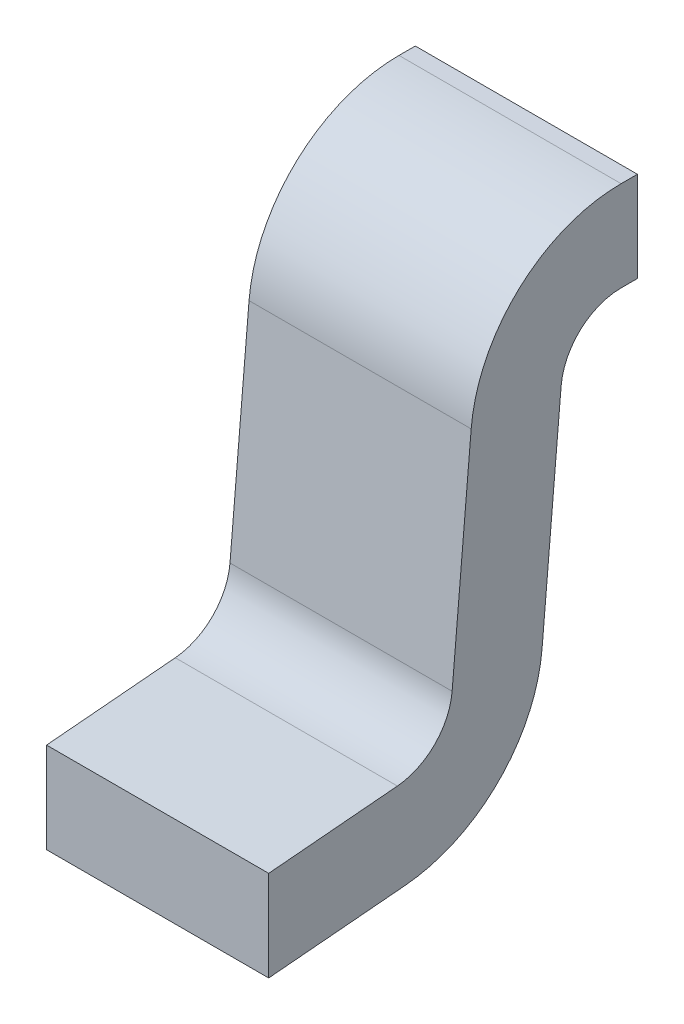
ISO-10303-21;
HEADER;
FILE_DESCRIPTION(('STEP AP214'),'2;1');
FILE_NAME('part.step','',(''),(''),'','','');
FILE_SCHEMA(('AUTOMOTIVE_DESIGN { 1 0 10303 214 1 1 1 1 }'));
ENDSEC;
DATA;
#1=APPLICATION_CONTEXT('core data for automotive mechanical design processes');
#2=APPLICATION_PROTOCOL_DEFINITION('international standard','automotive_design',2000,#1);
#3=PRODUCT_CONTEXT('',#1,'mechanical');
#4=PRODUCT('Part','Part','',(#3));
#5=PRODUCT_RELATED_PRODUCT_CATEGORY('part','',(#4));
#6=PRODUCT_DEFINITION_FORMATION('','',#4);
#7=PRODUCT_DEFINITION_CONTEXT('part definition',#1,'design');
#8=PRODUCT_DEFINITION('design','',#6,#7);
#9=PRODUCT_DEFINITION_SHAPE('','',#8);
#10=(LENGTH_UNIT() NAMED_UNIT(*) SI_UNIT(.MILLI.,.METRE.));
#11=(NAMED_UNIT(*) PLANE_ANGLE_UNIT() SI_UNIT($,.RADIAN.));
#12=(NAMED_UNIT(*) SI_UNIT($,.STERADIAN.) SOLID_ANGLE_UNIT());
#13=UNCERTAINTY_MEASURE_WITH_UNIT(LENGTH_MEASURE(1.E-05),#10,'distance_accuracy_value','');
#14=(GEOMETRIC_REPRESENTATION_CONTEXT(3) GLOBAL_UNCERTAINTY_ASSIGNED_CONTEXT((#13)) GLOBAL_UNIT_ASSIGNED_CONTEXT((#10,
#11,#12)) REPRESENTATION_CONTEXT('',''));
#15=CARTESIAN_POINT('',(0.,0.,0.));
#16=DIRECTION('',(0.,0.,1.));
#17=DIRECTION('',(1.,0.,0.));
#18=AXIS2_PLACEMENT_3D('',#15,#16,#17);
#19=CARTESIAN_POINT('',(-0.187452,0.,0.));
#20=DIRECTION('',(1.,0.,0.));
#21=DIRECTION('',(0.,1.,0.));
#22=AXIS2_PLACEMENT_3D('',#19,#20,#21);
#23=PLANE('',#22);
#24=DIRECTION('',(0.,-0.0871557427476379,0.996194698091747));
#25=VECTOR('',#24,1.);
#26=CARTESIAN_POINT('',(-0.187452,-0.03121454129347,0.23999111031));
#27=LINE('',#26,#25);
#28=CARTESIAN_POINT('',(-0.187452,-0.03121454129347,0.23999111031));
#29=VERTEX_POINT('',#28);
#30=CARTESIAN_POINT('',(-0.187452,-0.0502178567584,0.4572));
#31=VERTEX_POINT('',#30);
#32=EDGE_CURVE('E39',#29,#31,#27,.T.);
#33=ORIENTED_EDGE('',*,*,#32,.F.);
#34=CARTESIAN_POINT('',(-0.187452,0.06999884003265,0.248846133773));
#35=DIRECTION('',(1.,0.,0.));
#36=DIRECTION('',(0.,-0.996194698091747,-0.0871557427476379));
#37=AXIS2_PLACEMENT_3D('',#34,#35,#36);
#38=CIRCLE('',#37,0.1016);
#39=CARTESIAN_POINT('',(-0.187452,0.0611438165695,0.147632752447));
#40=VERTEX_POINT('',#39);
#41=EDGE_CURVE('E11',#29,#40,#38,.T.);
#42=ORIENTED_EDGE('',*,*,#41,.T.);
#43=DIRECTION('',(0.,0.996194698091747,-0.0871557427476379));
#44=VECTOR('',#43,1.);
#45=CARTESIAN_POINT('',(-0.187452,0.0611438165695,0.147632752447));
#46=LINE('',#45,#44);
#47=CARTESIAN_POINT('',(-0.187452,0.428537558658,0.115489964964));
#48=VERTEX_POINT('',#47);
#49=EDGE_CURVE('E26',#40,#48,#46,.T.);
#50=ORIENTED_EDGE('',*,*,#49,.T.);
#51=CARTESIAN_POINT('',(-0.187452,0.4064,-0.137543488351));
#52=DIRECTION('',(-1.,0.,0.));
#53=DIRECTION('',(0.,0.0871557427476379,0.996194698091747));
#54=AXIS2_PLACEMENT_3D('',#51,#52,#53);
#55=CIRCLE('',#54,0.254);
#56=CARTESIAN_POINT('',(-0.187452,0.6604,-0.137543488351));
#57=VERTEX_POINT('',#56);
#58=EDGE_CURVE('E220',#48,#57,#55,.T.);
#59=ORIENTED_EDGE('',*,*,#58,.T.);
#60=DIRECTION('',(0.,0.,1.));
#61=VECTOR('',#60,1.);
#62=CARTESIAN_POINT('',(-0.187452,0.6604,-0.1651));
#63=LINE('',#62,#61);
#64=CARTESIAN_POINT('',(-0.187452,0.6604,-0.1651));
#65=VERTEX_POINT('',#64);
#66=EDGE_CURVE('E251',#65,#57,#63,.T.);
#67=ORIENTED_EDGE('',*,*,#66,.F.);
#68=DIRECTION('',(0.,1.,0.));
#69=VECTOR('',#68,1.);
#70=CARTESIAN_POINT('',(-0.187452,0.508,-0.1651));
#71=LINE('',#70,#69);
#72=CARTESIAN_POINT('',(-0.187452,0.508,-0.1651));
#73=VERTEX_POINT('',#72);
#74=EDGE_CURVE('E194',#73,#65,#71,.T.);
#75=ORIENTED_EDGE('',*,*,#74,.F.);
#76=DIRECTION('',(0.,0.,-1.));
#77=VECTOR('',#76,1.);
#78=CARTESIAN_POINT('',(-0.187452,0.508,-0.137543488351));
#79=LINE('',#78,#77);
#80=CARTESIAN_POINT('',(-0.187452,0.508,-0.137543488351));
#81=VERTEX_POINT('',#80);
#82=EDGE_CURVE('E195',#81,#73,#79,.T.);
#83=ORIENTED_EDGE('',*,*,#82,.F.);
#84=CARTESIAN_POINT('',(-0.187452,0.4064,-0.137543488351));
#85=DIRECTION('',(1.,0.,0.));
#86=DIRECTION('',(0.,1.,0.));
#87=AXIS2_PLACEMENT_3D('',#84,#85,#86);
#88=CIRCLE('',#87,0.1016);
#89=CARTESIAN_POINT('',(-0.187452,0.415255023463,-0.03633010702521));
#90=VERTEX_POINT('',#89);
#91=EDGE_CURVE('E224',#81,#90,#88,.T.);
#92=ORIENTED_EDGE('',*,*,#91,.T.);
#93=DIRECTION('',(0.,-0.996194698091747,0.0871557427476379));
#94=VECTOR('',#93,1.);
#95=CARTESIAN_POINT('',(-0.187452,0.415255023463,-0.03633010702521));
#96=LINE('',#95,#94);
#97=CARTESIAN_POINT('',(-0.187452,0.04786128137476,-0.004187319542116));
#98=VERTEX_POINT('',#97);
#99=EDGE_CURVE('E228',#90,#98,#96,.T.);
#100=ORIENTED_EDGE('',*,*,#99,.T.);
#101=CARTESIAN_POINT('',(-0.187452,0.06999884003265,0.248846133773));
#102=DIRECTION('',(-1.,0.,0.));
#103=DIRECTION('',(0.,-0.0871557427476379,-0.996194698091747));
#104=AXIS2_PLACEMENT_3D('',#101,#102,#103);
#105=CIRCLE('',#104,0.254);
#106=CARTESIAN_POINT('',(-0.187452,-0.183034613283,0.226708575115));
#107=VERTEX_POINT('',#106);
#108=EDGE_CURVE('E269',#98,#107,#105,.T.);
#109=ORIENTED_EDGE('',*,*,#108,.T.);
#110=DIRECTION('',(0.,0.0871557427476379,-0.996194698091747));
#111=VECTOR('',#110,1.);
#112=CARTESIAN_POINT('',(-0.187452,-0.2032,0.4572));
#113=LINE('',#112,#111);
#114=CARTESIAN_POINT('',(-0.187452,-0.2032,0.4572));
#115=VERTEX_POINT('',#114);
#116=EDGE_CURVE('E208',#115,#107,#113,.T.);
#117=ORIENTED_EDGE('',*,*,#116,.F.);
#118=DIRECTION('',(0.,1.,0.));
#119=VECTOR('',#118,1.);
#120=CARTESIAN_POINT('',(-0.187452,-0.2032,0.4572));
#121=LINE('',#120,#119);
#122=EDGE_CURVE('E164',#115,#31,#121,.T.);
#123=ORIENTED_EDGE('',*,*,#122,.T.);
#124=EDGE_LOOP('',(#33,#42,#50,#59,#67,#75,#83,#92,#100,#109,#117,#123));
#125=FACE_BOUND('',#124,.T.);
#126=ADVANCED_FACE('F16',(#125),#23,.F.);
#127=CARTESIAN_POINT('',(0.2249424,-0.2032,0.4572));
#128=DIRECTION('',(0.,0.,-1.));
#129=DIRECTION('',(0.,-1.,0.));
#130=AXIS2_PLACEMENT_3D('',#127,#128,#129);
#131=PLANE('',#130);
#132=DIRECTION('',(1.,0.,0.));
#133=VECTOR('',#132,1.);
#134=CARTESIAN_POINT('',(-0.187452,-0.2032,0.4572));
#135=LINE('',#134,#133);
#136=CARTESIAN_POINT('',(0.187452,-0.2032,0.4572));
#137=VERTEX_POINT('',#136);
#138=EDGE_CURVE('E159',#115,#137,#135,.T.);
#139=ORIENTED_EDGE('',*,*,#138,.T.);
#140=DIRECTION('',(0.,1.,0.));
#141=VECTOR('',#140,1.);
#142=CARTESIAN_POINT('',(0.187452,-0.2032,0.4572));
#143=LINE('',#142,#141);
#144=CARTESIAN_POINT('',(0.187452,-0.0502178567584,0.4572));
#145=VERTEX_POINT('',#144);
#146=EDGE_CURVE('E147',#137,#145,#143,.T.);
#147=ORIENTED_EDGE('',*,*,#146,.T.);
#148=DIRECTION('',(1.,0.,0.));
#149=VECTOR('',#148,1.);
#150=CARTESIAN_POINT('',(-0.187452,-0.0502178567584,0.4572));
#151=LINE('',#150,#149);
#152=EDGE_CURVE('E186',#31,#145,#151,.T.);
#153=ORIENTED_EDGE('',*,*,#152,.F.);
#154=ORIENTED_EDGE('',*,*,#122,.F.);
#155=EDGE_LOOP('',(#139,#147,#153,#154));
#156=FACE_BOUND('',#155,.T.);
#157=ADVANCED_FACE('F163',(#156),#131,.F.);
#158=CARTESIAN_POINT('',(-0.187452,-0.02378429437146,0.155062999369));
#159=DIRECTION('',(0.,0.996194698091747,0.0871557427476379));
#160=DIRECTION('',(1.,0.,0.));
#161=AXIS2_PLACEMENT_3D('',#158,#159,#160);
#162=PLANE('',#161);
#163=DIRECTION('',(0.,-0.0871557427476379,0.996194698091747));
#164=VECTOR('',#163,1.);
#165=CARTESIAN_POINT('',(0.187452,-0.03121454129347,0.23999111031));
#166=LINE('',#165,#164);
#167=CARTESIAN_POINT('',(0.187452,-0.03121454129347,0.23999111031));
#168=VERTEX_POINT('',#167);
#169=EDGE_CURVE('E155',#168,#145,#166,.T.);
#170=ORIENTED_EDGE('',*,*,#169,.F.);
#171=DIRECTION('',(1.,0.,0.));
#172=VECTOR('',#171,1.);
#173=CARTESIAN_POINT('',(-0.187452,-0.03121454129347,0.23999111031));
#174=LINE('',#173,#172);
#175=EDGE_CURVE('E273',#29,#168,#174,.T.);
#176=ORIENTED_EDGE('',*,*,#175,.F.);
#177=ORIENTED_EDGE('',*,*,#32,.T.);
#178=ORIENTED_EDGE('',*,*,#152,.T.);
#179=EDGE_LOOP('',(#170,#176,#177,#178));
#180=FACE_BOUND('',#179,.T.);
#181=ADVANCED_FACE('F342',(#180),#162,.T.);
#182=CARTESIAN_POINT('',(-0.187452,0.06999884003265,0.248846133773));
#183=DIRECTION('',(1.,0.,0.));
#184=DIRECTION('',(0.,-0.996194698091747,-0.0871557427476379));
#185=AXIS2_PLACEMENT_3D('',#182,#183,#184);
#186=CYLINDRICAL_SURFACE('',#185,0.1016);
#187=CARTESIAN_POINT('',(0.187452,0.06999884003265,0.248846133773));
#188=DIRECTION('',(1.,0.,0.));
#189=DIRECTION('',(0.,-0.996194698091747,-0.0871557427476379));
#190=AXIS2_PLACEMENT_3D('',#187,#188,#189);
#191=CIRCLE('',#190,0.1016);
#192=CARTESIAN_POINT('',(0.187452,0.0611438165695,0.147632752447));
#193=VERTEX_POINT('',#192);
#194=EDGE_CURVE('E189',#168,#193,#191,.T.);
#195=ORIENTED_EDGE('',*,*,#194,.T.);
#196=DIRECTION('',(1.,0.,0.));
#197=VECTOR('',#196,1.);
#198=CARTESIAN_POINT('',(-0.187452,0.0611438165695,0.147632752447));
#199=LINE('',#198,#197);
#200=EDGE_CURVE('E199',#40,#193,#199,.T.);
#201=ORIENTED_EDGE('',*,*,#200,.F.);
#202=ORIENTED_EDGE('',*,*,#41,.F.);
#203=ORIENTED_EDGE('',*,*,#175,.T.);
#204=EDGE_LOOP('',(#195,#201,#202,#203));
#205=FACE_BOUND('',#204,.T.);
#206=ADVANCED_FACE('F348',(#205),#186,.F.);
#207=CARTESIAN_POINT('',(-0.187452,0.01328253519474,0.151820071989));
#208=DIRECTION('',(0.,0.0871557427476379,0.996194698091747));
#209=DIRECTION('',(1.,0.,0.));
#210=AXIS2_PLACEMENT_3D('',#207,#208,#209);
#211=PLANE('',#210);
#212=ORIENTED_EDGE('',*,*,#200,.T.);
#213=DIRECTION('',(0.,-0.996194698091747,0.0871557427476379));
#214=VECTOR('',#213,1.);
#215=CARTESIAN_POINT('',(0.187452,0.428537558658,0.115489964964));
#216=LINE('',#215,#214);
#217=CARTESIAN_POINT('',(0.187452,0.428537558658,0.115489964964));
#218=VERTEX_POINT('',#217);
#219=EDGE_CURVE('E68',#218,#193,#216,.T.);
#220=ORIENTED_EDGE('',*,*,#219,.F.);
#221=DIRECTION('',(1.,0.,0.));
#222=VECTOR('',#221,1.);
#223=CARTESIAN_POINT('',(-0.187452,0.428537558658,0.115489964964));
#224=LINE('',#223,#222);
#225=EDGE_CURVE('E200',#48,#218,#224,.T.);
#226=ORIENTED_EDGE('',*,*,#225,.F.);
#227=ORIENTED_EDGE('',*,*,#49,.F.);
#228=EDGE_LOOP('',(#212,#220,#226,#227));
#229=FACE_BOUND('',#228,.T.);
#230=ADVANCED_FACE('F237',(#229),#211,.T.);
#231=CARTESIAN_POINT('',(-0.187452,0.4064,-0.137543488351));
#232=DIRECTION('',(-1.,0.,0.));
#233=DIRECTION('',(0.,0.0871557427476379,0.996194698091747));
#234=AXIS2_PLACEMENT_3D('',#231,#232,#233);
#235=CYLINDRICAL_SURFACE('',#234,0.254);
#236=CARTESIAN_POINT('',(0.187452,0.4064,-0.137543488351));
#237=DIRECTION('',(-1.,0.,0.));
#238=DIRECTION('',(0.,0.0871557427476379,0.996194698091747));
#239=AXIS2_PLACEMENT_3D('',#236,#237,#238);
#240=CIRCLE('',#239,0.254);
#241=CARTESIAN_POINT('',(0.187452,0.6604,-0.137543488351));
#242=VERTEX_POINT('',#241);
#243=EDGE_CURVE('E196',#218,#242,#240,.T.);
#244=ORIENTED_EDGE('',*,*,#243,.T.);
#245=DIRECTION('',(1.,0.,0.));
#246=VECTOR('',#245,1.);
#247=CARTESIAN_POINT('',(-0.187452,0.6604,-0.137543488351));
#248=LINE('',#247,#246);
#249=EDGE_CURVE('E80',#57,#242,#248,.T.);
#250=ORIENTED_EDGE('',*,*,#249,.F.);
#251=ORIENTED_EDGE('',*,*,#58,.F.);
#252=ORIENTED_EDGE('',*,*,#225,.T.);
#253=EDGE_LOOP('',(#244,#250,#251,#252));
#254=FACE_BOUND('',#253,.T.);
#255=ADVANCED_FACE('F240',(#254),#235,.T.);
#256=CARTESIAN_POINT('',(-0.187452,0.6604,-0.1651));
#257=DIRECTION('',(0.,1.,0.));
#258=DIRECTION('',(1.,0.,0.));
#259=AXIS2_PLACEMENT_3D('',#256,#257,#258);
#260=PLANE('',#259);
#261=ORIENTED_EDGE('',*,*,#249,.T.);
#262=DIRECTION('',(0.,0.,1.));
#263=VECTOR('',#262,1.);
#264=CARTESIAN_POINT('',(0.187452,0.6604,-0.1651));
#265=LINE('',#264,#263);
#266=CARTESIAN_POINT('',(0.187452,0.6604,-0.1651));
#267=VERTEX_POINT('',#266);
#268=EDGE_CURVE('E201',#267,#242,#265,.T.);
#269=ORIENTED_EDGE('',*,*,#268,.F.);
#270=DIRECTION('',(1.,0.,0.));
#271=VECTOR('',#270,1.);
#272=CARTESIAN_POINT('',(-0.187452,0.6604,-0.1651));
#273=LINE('',#272,#271);
#274=EDGE_CURVE('E245',#65,#267,#273,.T.);
#275=ORIENTED_EDGE('',*,*,#274,.F.);
#276=ORIENTED_EDGE('',*,*,#66,.T.);
#277=EDGE_LOOP('',(#261,#269,#275,#276));
#278=FACE_BOUND('',#277,.T.);
#279=ADVANCED_FACE('F244',(#278),#260,.T.);
#280=CARTESIAN_POINT('',(-0.187452,0.508,-0.1651));
#281=DIRECTION('',(0.,0.,-1.));
#282=DIRECTION('',(0.,-1.,0.));
#283=AXIS2_PLACEMENT_3D('',#280,#281,#282);
#284=PLANE('',#283);
#285=ORIENTED_EDGE('',*,*,#274,.T.);
#286=DIRECTION('',(0.,1.,0.));
#287=VECTOR('',#286,1.);
#288=CARTESIAN_POINT('',(0.187452,0.508,-0.1651));
#289=LINE('',#288,#287);
#290=CARTESIAN_POINT('',(0.187452,0.508,-0.1651));
#291=VERTEX_POINT('',#290);
#292=EDGE_CURVE('E205',#291,#267,#289,.T.);
#293=ORIENTED_EDGE('',*,*,#292,.F.);
#294=DIRECTION('',(1.,0.,0.));
#295=VECTOR('',#294,1.);
#296=CARTESIAN_POINT('',(-0.187452,0.508,-0.1651));
#297=LINE('',#296,#295);
#298=EDGE_CURVE('E190',#73,#291,#297,.T.);
#299=ORIENTED_EDGE('',*,*,#298,.F.);
#300=ORIENTED_EDGE('',*,*,#74,.T.);
#301=EDGE_LOOP('',(#285,#293,#299,#300));
#302=FACE_BOUND('',#301,.T.);
#303=ADVANCED_FACE('F247',(#302),#284,.T.);
#304=CARTESIAN_POINT('',(-0.187452,0.508,-0.04444424107116));
#305=DIRECTION('',(0.,-1.,0.));
#306=DIRECTION('',(0.,0.,-1.));
#307=AXIS2_PLACEMENT_3D('',#304,#305,#306);
#308=PLANE('',#307);
#309=ORIENTED_EDGE('',*,*,#298,.T.);
#310=DIRECTION('',(0.,0.,-1.));
#311=VECTOR('',#310,1.);
#312=CARTESIAN_POINT('',(0.187452,0.508,-0.137543488351));
#313=LINE('',#312,#311);
#314=CARTESIAN_POINT('',(0.187452,0.508,-0.137543488351));
#315=VERTEX_POINT('',#314);
#316=EDGE_CURVE('E181',#315,#291,#313,.T.);
#317=ORIENTED_EDGE('',*,*,#316,.F.);
#318=DIRECTION('',(1.,0.,0.));
#319=VECTOR('',#318,1.);
#320=CARTESIAN_POINT('',(-0.187452,0.508,-0.137543488351));
#321=LINE('',#320,#319);
#322=EDGE_CURVE('E179',#81,#315,#321,.T.);
#323=ORIENTED_EDGE('',*,*,#322,.F.);
#324=ORIENTED_EDGE('',*,*,#82,.T.);
#325=EDGE_LOOP('',(#309,#317,#323,#324));
#326=FACE_BOUND('',#325,.T.);
#327=ADVANCED_FACE('F404',(#326),#308,.T.);
#328=CARTESIAN_POINT('',(-0.187452,0.4064,-0.137543488351));
#329=DIRECTION('',(1.,0.,0.));
#330=DIRECTION('',(0.,1.,0.));
#331=AXIS2_PLACEMENT_3D('',#328,#329,#330);
#332=CYLINDRICAL_SURFACE('',#331,0.1016);
#333=CARTESIAN_POINT('',(0.187452,0.4064,-0.137543488351));
#334=DIRECTION('',(1.,0.,0.));
#335=DIRECTION('',(0.,1.,0.));
#336=AXIS2_PLACEMENT_3D('',#333,#334,#335);
#337=CIRCLE('',#336,0.1016);
#338=CARTESIAN_POINT('',(0.187452,0.415255023463,-0.03633010702521));
#339=VERTEX_POINT('',#338);
#340=EDGE_CURVE('E219',#315,#339,#337,.T.);
#341=ORIENTED_EDGE('',*,*,#340,.T.);
#342=DIRECTION('',(1.,0.,0.));
#343=VECTOR('',#342,1.);
#344=CARTESIAN_POINT('',(-0.187452,0.415255023463,-0.03633010702521));
#345=LINE('',#344,#343);
#346=EDGE_CURVE('E19',#90,#339,#345,.T.);
#347=ORIENTED_EDGE('',*,*,#346,.F.);
#348=ORIENTED_EDGE('',*,*,#91,.F.);
#349=ORIENTED_EDGE('',*,*,#322,.T.);
#350=EDGE_LOOP('',(#341,#347,#348,#349));
#351=FACE_BOUND('',#350,.T.);
#352=ADVANCED_FACE('F409',(#351),#332,.F.);
#353=CARTESIAN_POINT('',(-0.187452,-0.164458995978,0.0143882977629));
#354=DIRECTION('',(0.,-0.0871557427476379,-0.996194698091747));
#355=DIRECTION('',(0.,-0.996194698091747,0.0871557427476379));
#356=AXIS2_PLACEMENT_3D('',#353,#354,#355);
#357=PLANE('',#356);
#358=DIRECTION('',(1.,0.,0.));
#359=VECTOR('',#358,1.);
#360=CARTESIAN_POINT('',(-0.187452,0.04786128137476,-0.004187319542116));
#361=LINE('',#360,#359);
#362=CARTESIAN_POINT('',(0.187452,0.04786128137476,-0.004187319542116));
#363=VERTEX_POINT('',#362);
#364=EDGE_CURVE('E261',#98,#363,#361,.T.);
#365=ORIENTED_EDGE('',*,*,#364,.F.);
#366=ORIENTED_EDGE('',*,*,#99,.F.);
#367=ORIENTED_EDGE('',*,*,#346,.T.);
#368=DIRECTION('',(0.,0.996194698091747,-0.0871557427476379));
#369=VECTOR('',#368,1.);
#370=CARTESIAN_POINT('',(0.187452,0.04786128137476,-0.004187319542116));
#371=LINE('',#370,#369);
#372=EDGE_CURVE('E172',#363,#339,#371,.T.);
#373=ORIENTED_EDGE('',*,*,#372,.F.);
#374=EDGE_LOOP('',(#365,#366,#367,#373));
#375=FACE_BOUND('',#374,.T.);
#376=ADVANCED_FACE('F414',(#375),#357,.T.);
#377=CARTESIAN_POINT('',(0.187452,0.,0.));
#378=DIRECTION('',(1.,0.,0.));
#379=DIRECTION('',(0.,1.,0.));
#380=AXIS2_PLACEMENT_3D('',#377,#378,#379);
#381=PLANE('',#380);
#382=DIRECTION('',(0.,0.0871557427476379,-0.996194698091747));
#383=VECTOR('',#382,1.);
#384=CARTESIAN_POINT('',(0.187452,-0.2032,0.4572));
#385=LINE('',#384,#383);
#386=CARTESIAN_POINT('',(0.187452,-0.183034613283,0.226708575115));
#387=VERTEX_POINT('',#386);
#388=EDGE_CURVE('E152',#137,#387,#385,.T.);
#389=ORIENTED_EDGE('',*,*,#388,.T.);
#390=CARTESIAN_POINT('',(0.187452,0.06999884003265,0.248846133773));
#391=DIRECTION('',(-1.,0.,0.));
#392=DIRECTION('',(0.,-0.0871557427476379,-0.996194698091747));
#393=AXIS2_PLACEMENT_3D('',#390,#391,#392);
#394=CIRCLE('',#393,0.254);
#395=EDGE_CURVE('E264',#363,#387,#394,.T.);
#396=ORIENTED_EDGE('',*,*,#395,.F.);
#397=ORIENTED_EDGE('',*,*,#372,.T.);
#398=ORIENTED_EDGE('',*,*,#340,.F.);
#399=ORIENTED_EDGE('',*,*,#316,.T.);
#400=ORIENTED_EDGE('',*,*,#292,.T.);
#401=ORIENTED_EDGE('',*,*,#268,.T.);
#402=ORIENTED_EDGE('',*,*,#243,.F.);
#403=ORIENTED_EDGE('',*,*,#219,.T.);
#404=ORIENTED_EDGE('',*,*,#194,.F.);
#405=ORIENTED_EDGE('',*,*,#169,.T.);
#406=ORIENTED_EDGE('',*,*,#146,.F.);
#407=EDGE_LOOP('',(#389,#396,#397,#398,#399,#400,#401,#402,#403,#404,#405,#406));
#408=FACE_BOUND('',#407,.T.);
#409=ADVANCED_FACE('F149',(#408),#381,.T.);
#410=CARTESIAN_POINT('',(-0.187452,0.06999884003265,0.248846133773));
#411=DIRECTION('',(-1.,0.,0.));
#412=DIRECTION('',(0.,-0.0871557427476379,-0.996194698091747));
#413=AXIS2_PLACEMENT_3D('',#410,#411,#412);
#414=CYLINDRICAL_SURFACE('',#413,0.254);
#415=ORIENTED_EDGE('',*,*,#395,.T.);
#416=DIRECTION('',(1.,0.,0.));
#417=VECTOR('',#416,1.);
#418=CARTESIAN_POINT('',(-0.187452,-0.183034613283,0.226708575115));
#419=LINE('',#418,#417);
#420=EDGE_CURVE('E170',#107,#387,#419,.T.);
#421=ORIENTED_EDGE('',*,*,#420,.F.);
#422=ORIENTED_EDGE('',*,*,#108,.F.);
#423=ORIENTED_EDGE('',*,*,#364,.T.);
#424=EDGE_LOOP('',(#415,#421,#422,#423));
#425=FACE_BOUND('',#424,.T.);
#426=ADVANCED_FACE('F361',(#425),#414,.T.);
#427=CARTESIAN_POINT('',(-0.187452,-0.2032,0.4572));
#428=DIRECTION('',(0.,-0.996194698091747,-0.0871557427476379));
#429=DIRECTION('',(0.,0.0871557427476379,-0.996194698091747));
#430=AXIS2_PLACEMENT_3D('',#427,#428,#429);
#431=PLANE('',#430);
#432=ORIENTED_EDGE('',*,*,#116,.T.);
#433=ORIENTED_EDGE('',*,*,#420,.T.);
#434=ORIENTED_EDGE('',*,*,#388,.F.);
#435=ORIENTED_EDGE('',*,*,#138,.F.);
#436=EDGE_LOOP('',(#432,#433,#434,#435));
#437=FACE_BOUND('',#436,.T.);
#438=ADVANCED_FACE('F168',(#437),#431,.T.);
#439=CLOSED_SHELL('',(#126,#157,#181,#206,#230,#255,#279,#303,#327,#352,#376,#409,#426,#438));
#440=MANIFOLD_SOLID_BREP('B1',#439);
#441=ADVANCED_BREP_SHAPE_REPRESENTATION('',(#18,#440),#14);
#442=SHAPE_DEFINITION_REPRESENTATION(#9,#441);
ENDSEC;
END-ISO-10303-21;
